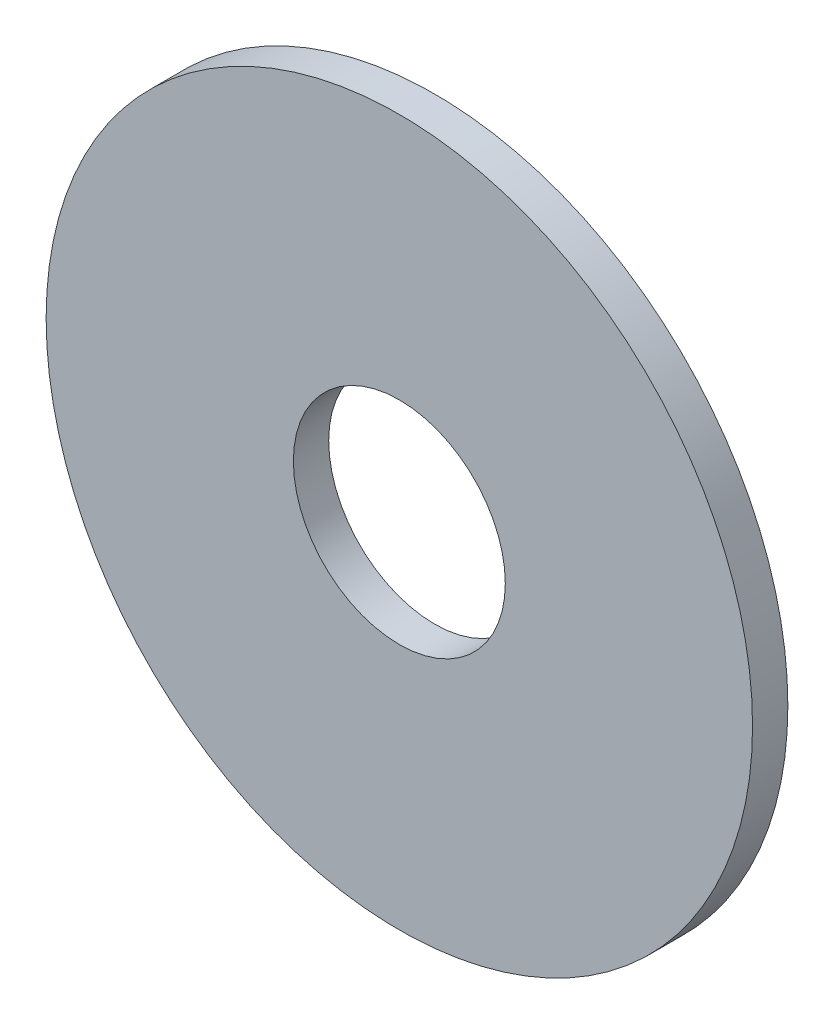
ISO-10303-21;
HEADER;
FILE_DESCRIPTION(('STEP AP214'),'2;1');
FILE_NAME('part.step','',(''),(''),'','','');
FILE_SCHEMA(('AUTOMOTIVE_DESIGN { 1 0 10303 214 1 1 1 1 }'));
ENDSEC;
DATA;
#1=APPLICATION_CONTEXT('core data for automotive mechanical design processes');
#2=APPLICATION_PROTOCOL_DEFINITION('international standard','automotive_design',2000,#1);
#3=PRODUCT_CONTEXT('',#1,'mechanical');
#4=PRODUCT('Part','Part','',(#3));
#5=PRODUCT_RELATED_PRODUCT_CATEGORY('part','',(#4));
#6=PRODUCT_DEFINITION_FORMATION('','',#4);
#7=PRODUCT_DEFINITION_CONTEXT('part definition',#1,'design');
#8=PRODUCT_DEFINITION('design','',#6,#7);
#9=PRODUCT_DEFINITION_SHAPE('','',#8);
#10=(LENGTH_UNIT() NAMED_UNIT(*) SI_UNIT(.MILLI.,.METRE.));
#11=(NAMED_UNIT(*) PLANE_ANGLE_UNIT() SI_UNIT($,.RADIAN.));
#12=(NAMED_UNIT(*) SI_UNIT($,.STERADIAN.) SOLID_ANGLE_UNIT());
#13=UNCERTAINTY_MEASURE_WITH_UNIT(LENGTH_MEASURE(1.E-05),#10,'distance_accuracy_value','');
#14=(GEOMETRIC_REPRESENTATION_CONTEXT(3) GLOBAL_UNCERTAINTY_ASSIGNED_CONTEXT((#13)) GLOBAL_UNIT_ASSIGNED_CONTEXT((#10,
#11,#12)) REPRESENTATION_CONTEXT('',''));
#15=CARTESIAN_POINT('',(0.,0.,0.));
#16=DIRECTION('',(0.,0.,1.));
#17=DIRECTION('',(1.,0.,0.));
#18=AXIS2_PLACEMENT_3D('',#15,#16,#17);
#19=CARTESIAN_POINT('',(0.,0.,10.));
#20=DIRECTION('',(0.,0.,-1.));
#21=DIRECTION('',(-1.,0.,0.));
#22=AXIS2_PLACEMENT_3D('',#19,#20,#21);
#23=CYLINDRICAL_SURFACE('',#22,100.);
#24=CARTESIAN_POINT('',(0.,0.,10.));
#25=DIRECTION('',(0.,0.,1.));
#26=DIRECTION('',(1.,0.,0.));
#27=AXIS2_PLACEMENT_3D('',#24,#25,#26);
#28=CIRCLE('',#27,100.);
#29=CARTESIAN_POINT('',(100.,0.,10.));
#30=VERTEX_POINT('',#29);
#31=EDGE_CURVE('E10',#30,#30,#28,.T.);
#32=ORIENTED_EDGE('',*,*,#31,.F.);
#33=EDGE_LOOP('',(#32));
#34=FACE_BOUND('',#33,.T.);
#35=CARTESIAN_POINT('',(0.,0.,0.));
#36=DIRECTION('',(0.,0.,1.));
#37=DIRECTION('',(1.,0.,0.));
#38=AXIS2_PLACEMENT_3D('',#35,#36,#37);
#39=CIRCLE('',#38,100.);
#40=CARTESIAN_POINT('',(100.,0.,0.));
#41=VERTEX_POINT('',#40);
#42=EDGE_CURVE('E40',#41,#41,#39,.T.);
#43=ORIENTED_EDGE('',*,*,#42,.T.);
#44=EDGE_LOOP('',(#43));
#45=FACE_BOUND('',#44,.T.);
#46=ADVANCED_FACE('F37',(#34,#45),#23,.T.);
#47=CARTESIAN_POINT('',(0.,0.,10.));
#48=DIRECTION('',(0.,0.,1.));
#49=DIRECTION('',(1.,0.,0.));
#50=AXIS2_PLACEMENT_3D('',#47,#48,#49);
#51=PLANE('',#50);
#52=CARTESIAN_POINT('',(0.,0.,10.));
#53=DIRECTION('',(0.,0.,1.));
#54=DIRECTION('',(1.,0.,0.));
#55=AXIS2_PLACEMENT_3D('',#52,#53,#54);
#56=CIRCLE('',#55,30.);
#57=CARTESIAN_POINT('',(30.,0.,10.));
#58=VERTEX_POINT('',#57);
#59=EDGE_CURVE('E51',#58,#58,#56,.T.);
#60=ORIENTED_EDGE('',*,*,#59,.F.);
#61=EDGE_LOOP('',(#60));
#62=FACE_BOUND('',#61,.T.);
#63=ORIENTED_EDGE('',*,*,#31,.T.);
#64=EDGE_LOOP('',(#63));
#65=FACE_BOUND('',#64,.T.);
#66=ADVANCED_FACE('F68',(#62,#65),#51,.T.);
#67=CARTESIAN_POINT('',(0.,0.,0.));
#68=DIRECTION('',(0.,0.,1.));
#69=DIRECTION('',(1.,0.,0.));
#70=AXIS2_PLACEMENT_3D('',#67,#68,#69);
#71=PLANE('',#70);
#72=CARTESIAN_POINT('',(0.,0.,0.));
#73=DIRECTION('',(0.,0.,1.));
#74=DIRECTION('',(1.,0.,0.));
#75=AXIS2_PLACEMENT_3D('',#72,#73,#74);
#76=CIRCLE('',#75,30.);
#77=CARTESIAN_POINT('',(30.,0.,0.));
#78=VERTEX_POINT('',#77);
#79=EDGE_CURVE('E49',#78,#78,#76,.T.);
#80=ORIENTED_EDGE('',*,*,#79,.T.);
#81=EDGE_LOOP('',(#80));
#82=FACE_BOUND('',#81,.T.);
#83=ORIENTED_EDGE('',*,*,#42,.F.);
#84=EDGE_LOOP('',(#83));
#85=FACE_BOUND('',#84,.T.);
#86=ADVANCED_FACE('F59',(#82,#85),#71,.F.);
#87=CARTESIAN_POINT('',(0.,0.,0.));
#88=DIRECTION('',(0.,0.,1.));
#89=DIRECTION('',(1.,0.,0.));
#90=AXIS2_PLACEMENT_3D('',#87,#88,#89);
#91=CYLINDRICAL_SURFACE('',#90,30.);
#92=ORIENTED_EDGE('',*,*,#79,.F.);
#93=EDGE_LOOP('',(#92));
#94=FACE_BOUND('',#93,.T.);
#95=ORIENTED_EDGE('',*,*,#59,.T.);
#96=EDGE_LOOP('',(#95));
#97=FACE_BOUND('',#96,.T.);
#98=ADVANCED_FACE('F62',(#94,#97),#91,.F.);
#99=CLOSED_SHELL('',(#46,#66,#86,#98));
#100=MANIFOLD_SOLID_BREP('B2',#99);
#101=ADVANCED_BREP_SHAPE_REPRESENTATION('',(#18,#100),#14);
#102=SHAPE_DEFINITION_REPRESENTATION(#9,#101);
ENDSEC;
END-ISO-10303-21;
